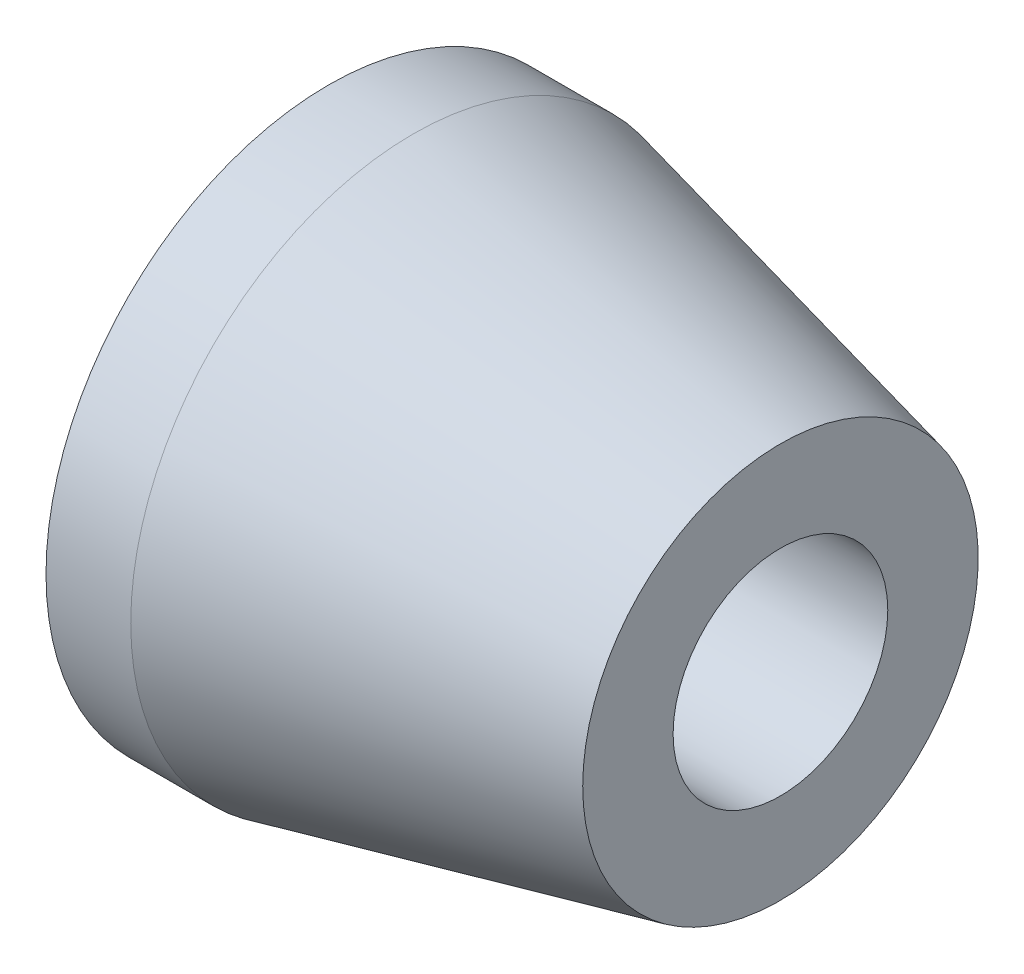
ISO-10303-21;
HEADER;
FILE_DESCRIPTION(('STEP AP214'),'2;1');
FILE_NAME('part.step','',(''),(''),'','','');
FILE_SCHEMA(('AUTOMOTIVE_DESIGN { 1 0 10303 214 1 1 1 1 }'));
ENDSEC;
DATA;
#1=APPLICATION_CONTEXT('core data for automotive mechanical design processes');
#2=APPLICATION_PROTOCOL_DEFINITION('international standard','automotive_design',2000,#1);
#3=PRODUCT_CONTEXT('',#1,'mechanical');
#4=PRODUCT('Part','Part','',(#3));
#5=PRODUCT_RELATED_PRODUCT_CATEGORY('part','',(#4));
#6=PRODUCT_DEFINITION_FORMATION('','',#4);
#7=PRODUCT_DEFINITION_CONTEXT('part definition',#1,'design');
#8=PRODUCT_DEFINITION('design','',#6,#7);
#9=PRODUCT_DEFINITION_SHAPE('','',#8);
#10=(LENGTH_UNIT() NAMED_UNIT(*) SI_UNIT(.MILLI.,.METRE.));
#11=(NAMED_UNIT(*) PLANE_ANGLE_UNIT() SI_UNIT($,.RADIAN.));
#12=(NAMED_UNIT(*) SI_UNIT($,.STERADIAN.) SOLID_ANGLE_UNIT());
#13=UNCERTAINTY_MEASURE_WITH_UNIT(LENGTH_MEASURE(1.E-05),#10,'distance_accuracy_value','');
#14=(GEOMETRIC_REPRESENTATION_CONTEXT(3) GLOBAL_UNCERTAINTY_ASSIGNED_CONTEXT((#13)) GLOBAL_UNIT_ASSIGNED_CONTEXT((#10,
#11,#12)) REPRESENTATION_CONTEXT('',''));
#15=CARTESIAN_POINT('',(0.,0.,0.));
#16=DIRECTION('',(0.,0.,1.));
#17=DIRECTION('',(1.,0.,0.));
#18=AXIS2_PLACEMENT_3D('',#15,#16,#17);
#19=CARTESIAN_POINT('',(3.,0.,0.));
#20=DIRECTION('',(-1.,0.,0.));
#21=DIRECTION('',(0.,0.,1.));
#22=AXIS2_PLACEMENT_3D('',#19,#20,#21);
#23=CYLINDRICAL_SURFACE('',#22,10.);
#24=CARTESIAN_POINT('',(3.,0.,0.));
#25=DIRECTION('',(-1.,0.,0.));
#26=DIRECTION('',(0.,0.,1.));
#27=AXIS2_PLACEMENT_3D('',#24,#25,#26);
#28=CIRCLE('',#27,10.);
#29=CARTESIAN_POINT('',(3.,0.,10.));
#30=VERTEX_POINT('',#29);
#31=EDGE_CURVE('E11',#30,#30,#28,.F.);
#32=ORIENTED_EDGE('',*,*,#31,.F.);
#33=EDGE_LOOP('',(#32));
#34=FACE_BOUND('',#33,.T.);
#35=CARTESIAN_POINT('',(0.,0.,0.));
#36=DIRECTION('',(1.,0.,0.));
#37=DIRECTION('',(0.,0.,-1.));
#38=AXIS2_PLACEMENT_3D('',#35,#36,#37);
#39=CIRCLE('',#38,10.);
#40=CARTESIAN_POINT('',(0.,0.,-10.));
#41=VERTEX_POINT('',#40);
#42=EDGE_CURVE('E47',#41,#41,#39,.T.);
#43=ORIENTED_EDGE('',*,*,#42,.T.);
#44=EDGE_LOOP('',(#43));
#45=FACE_BOUND('',#44,.T.);
#46=ADVANCED_FACE('F39',(#34,#45),#23,.T.);
#47=CARTESIAN_POINT('',(0.,0.,0.));
#48=DIRECTION('',(1.,0.,0.));
#49=DIRECTION('',(0.,0.,-1.));
#50=AXIS2_PLACEMENT_3D('',#47,#48,#49);
#51=PLANE('',#50);
#52=CARTESIAN_POINT('',(0.,0.,0.));
#53=DIRECTION('',(-1.,0.,0.));
#54=DIRECTION('',(0.,0.,1.));
#55=AXIS2_PLACEMENT_3D('',#52,#53,#54);
#56=CIRCLE('',#55,5.5);
#57=CARTESIAN_POINT('',(0.,0.,5.5));
#58=VERTEX_POINT('',#57);
#59=EDGE_CURVE('E55',#58,#58,#56,.T.);
#60=ORIENTED_EDGE('',*,*,#59,.F.);
#61=EDGE_LOOP('',(#60));
#62=FACE_BOUND('',#61,.T.);
#63=ORIENTED_EDGE('',*,*,#42,.F.);
#64=EDGE_LOOP('',(#63));
#65=FACE_BOUND('',#64,.T.);
#66=ADVANCED_FACE('F123',(#62,#65),#51,.F.);
#67=CARTESIAN_POINT('',(2.,0.,0.));
#68=DIRECTION('',(-1.,0.,0.));
#69=DIRECTION('',(0.,0.,1.));
#70=AXIS2_PLACEMENT_3D('',#67,#68,#69);
#71=CYLINDRICAL_SURFACE('',#70,5.5);
#72=CARTESIAN_POINT('',(2.,0.,0.));
#73=DIRECTION('',(-1.,0.,0.));
#74=DIRECTION('',(0.,0.,1.));
#75=AXIS2_PLACEMENT_3D('',#72,#73,#74);
#76=CIRCLE('',#75,5.5);
#77=CARTESIAN_POINT('',(2.,0.,5.5));
#78=VERTEX_POINT('',#77);
#79=EDGE_CURVE('E52',#78,#78,#76,.T.);
#80=ORIENTED_EDGE('',*,*,#79,.F.);
#81=EDGE_LOOP('',(#80));
#82=FACE_BOUND('',#81,.T.);
#83=ORIENTED_EDGE('',*,*,#59,.T.);
#84=EDGE_LOOP('',(#83));
#85=FACE_BOUND('',#84,.T.);
#86=ADVANCED_FACE('F118',(#82,#85),#71,.F.);
#87=CARTESIAN_POINT('',(2.,0.,0.));
#88=DIRECTION('',(-1.,0.,0.));
#89=DIRECTION('',(0.,0.,1.));
#90=AXIS2_PLACEMENT_3D('',#87,#88,#89);
#91=PLANE('',#90);
#92=CARTESIAN_POINT('',(2.,0.,0.));
#93=DIRECTION('',(-1.,0.,0.));
#94=DIRECTION('',(0.,0.,1.));
#95=AXIS2_PLACEMENT_3D('',#92,#93,#94);
#96=CIRCLE('',#95,3.8);
#97=CARTESIAN_POINT('',(2.,0.,3.8));
#98=VERTEX_POINT('',#97);
#99=EDGE_CURVE('E68',#98,#98,#96,.F.);
#100=ORIENTED_EDGE('',*,*,#99,.T.);
#101=EDGE_LOOP('',(#100));
#102=FACE_BOUND('',#101,.T.);
#103=ORIENTED_EDGE('',*,*,#79,.T.);
#104=EDGE_LOOP('',(#103));
#105=FACE_BOUND('',#104,.T.);
#106=ADVANCED_FACE('F86',(#102,#105),#91,.T.);
#107=CARTESIAN_POINT('',(16.,0.,0.));
#108=DIRECTION('',(-1.,0.,0.));
#109=DIRECTION('',(0.,0.,1.));
#110=AXIS2_PLACEMENT_3D('',#107,#108,#109);
#111=PLANE('',#110);
#112=CARTESIAN_POINT('',(16.,0.,0.));
#113=DIRECTION('',(1.,0.,0.));
#114=DIRECTION('',(0.,0.,-1.));
#115=AXIS2_PLACEMENT_3D('',#112,#113,#114);
#116=CIRCLE('',#115,3.8);
#117=CARTESIAN_POINT('',(16.,0.,-3.8));
#118=VERTEX_POINT('',#117);
#119=EDGE_CURVE('E106',#118,#118,#116,.T.);
#120=ORIENTED_EDGE('',*,*,#119,.F.);
#121=EDGE_LOOP('',(#120));
#122=FACE_BOUND('',#121,.T.);
#123=CARTESIAN_POINT('',(16.,0.,0.));
#124=DIRECTION('',(-1.,0.,0.));
#125=DIRECTION('',(0.,0.,1.));
#126=AXIS2_PLACEMENT_3D('',#123,#124,#125);
#127=CIRCLE('',#126,7.);
#128=CARTESIAN_POINT('',(16.,0.,7.));
#129=VERTEX_POINT('',#128);
#130=EDGE_CURVE('E59',#129,#129,#127,.T.);
#131=ORIENTED_EDGE('',*,*,#130,.F.);
#132=EDGE_LOOP('',(#131));
#133=FACE_BOUND('',#132,.T.);
#134=ADVANCED_FACE('F75',(#122,#133),#111,.F.);
#135=CARTESIAN_POINT('',(16.,0.,0.));
#136=DIRECTION('',(-1.,0.,0.));
#137=DIRECTION('',(0.,0.,1.));
#138=AXIS2_PLACEMENT_3D('',#135,#136,#137);
#139=CONICAL_SURFACE('',#138,7.,0.226798848053886);
#140=ORIENTED_EDGE('',*,*,#130,.T.);
#141=EDGE_LOOP('',(#140));
#142=FACE_BOUND('',#141,.T.);
#143=ORIENTED_EDGE('',*,*,#31,.T.);
#144=EDGE_LOOP('',(#143));
#145=FACE_BOUND('',#144,.T.);
#146=ADVANCED_FACE('F85',(#142,#145),#139,.T.);
#147=CARTESIAN_POINT('',(-8.74802307403552,0.,0.));
#148=DIRECTION('',(1.,0.,0.));
#149=DIRECTION('',(0.,0.,-1.));
#150=AXIS2_PLACEMENT_3D('',#147,#148,#149);
#151=CYLINDRICAL_SURFACE('',#150,3.8);
#152=ORIENTED_EDGE('',*,*,#119,.T.);
#153=EDGE_LOOP('',(#152));
#154=FACE_BOUND('',#153,.T.);
#155=ORIENTED_EDGE('',*,*,#99,.F.);
#156=EDGE_LOOP('',(#155));
#157=FACE_BOUND('',#156,.T.);
#158=ADVANCED_FACE('F88',(#154,#157),#151,.F.);
#159=CLOSED_SHELL('',(#46,#66,#86,#106,#134,#146,#158));
#160=MANIFOLD_SOLID_BREP('B2',#159);
#161=ADVANCED_BREP_SHAPE_REPRESENTATION('',(#18,#160),#14);
#162=SHAPE_DEFINITION_REPRESENTATION(#9,#161);
ENDSEC;
END-ISO-10303-21;
